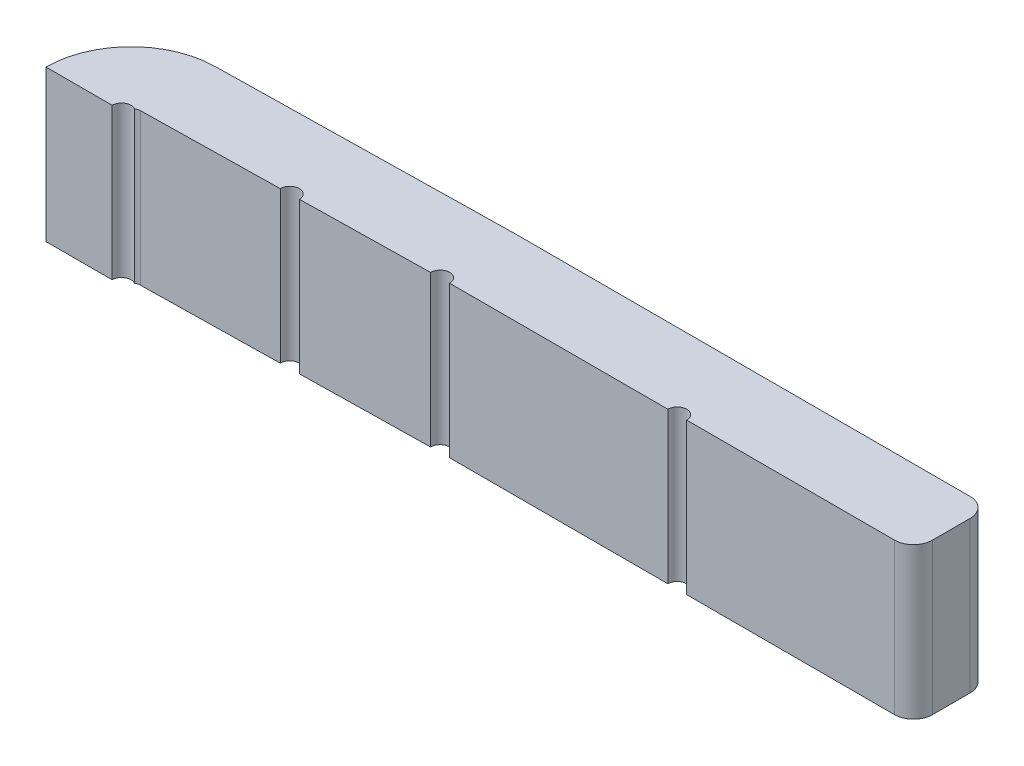
ISO-10303-21;
HEADER;
FILE_DESCRIPTION(('STEP AP214'),'2;1');
FILE_NAME('part.step','',(''),(''),'','','');
FILE_SCHEMA(('AUTOMOTIVE_DESIGN { 1 0 10303 214 1 1 1 1 }'));
ENDSEC;
DATA;
#1=APPLICATION_CONTEXT('core data for automotive mechanical design processes');
#2=APPLICATION_PROTOCOL_DEFINITION('international standard','automotive_design',2000,#1);
#3=PRODUCT_CONTEXT('',#1,'mechanical');
#4=PRODUCT('Part','Part','',(#3));
#5=PRODUCT_RELATED_PRODUCT_CATEGORY('part','',(#4));
#6=PRODUCT_DEFINITION_FORMATION('','',#4);
#7=PRODUCT_DEFINITION_CONTEXT('part definition',#1,'design');
#8=PRODUCT_DEFINITION('design','',#6,#7);
#9=PRODUCT_DEFINITION_SHAPE('','',#8);
#10=(LENGTH_UNIT() NAMED_UNIT(*) SI_UNIT(.MILLI.,.METRE.));
#11=(NAMED_UNIT(*) PLANE_ANGLE_UNIT() SI_UNIT($,.RADIAN.));
#12=(NAMED_UNIT(*) SI_UNIT($,.STERADIAN.) SOLID_ANGLE_UNIT());
#13=UNCERTAINTY_MEASURE_WITH_UNIT(LENGTH_MEASURE(1.E-05),#10,'distance_accuracy_value','');
#14=(GEOMETRIC_REPRESENTATION_CONTEXT(3) GLOBAL_UNCERTAINTY_ASSIGNED_CONTEXT((#13)) GLOBAL_UNIT_ASSIGNED_CONTEXT((#10,
#11,#12)) REPRESENTATION_CONTEXT('',''));
#15=CARTESIAN_POINT('',(0.,0.,0.));
#16=DIRECTION('',(0.,0.,1.));
#17=DIRECTION('',(1.,0.,0.));
#18=AXIS2_PLACEMENT_3D('',#15,#16,#17);
#19=CARTESIAN_POINT('',(0.25,0.8,0.));
#20=DIRECTION('',(0.,-1.,0.));
#21=DIRECTION('',(0.,0.,-1.));
#22=AXIS2_PLACEMENT_3D('',#19,#20,#21);
#23=CYLINDRICAL_SURFACE('',#22,0.45);
#24=DIRECTION('',(0.,-1.,0.));
#25=VECTOR('',#24,1.);
#26=CARTESIAN_POINT('',(-0.2,0.8,0.));
#27=LINE('',#26,#25);
#28=CARTESIAN_POINT('',(-0.2,0.8,0.));
#29=VERTEX_POINT('',#28);
#30=CARTESIAN_POINT('',(-0.2,0.,0.));
#31=VERTEX_POINT('',#30);
#32=EDGE_CURVE('E55',#29,#31,#27,.T.);
#33=ORIENTED_EDGE('',*,*,#32,.F.);
#34=CARTESIAN_POINT('',(0.25,0.8,0.));
#35=DIRECTION('',(0.,1.,0.));
#36=DIRECTION('',(0.,0.,-1.));
#37=AXIS2_PLACEMENT_3D('',#34,#35,#36);
#38=CIRCLE('',#37,0.45);
#39=CARTESIAN_POINT('',(0.242146417103225,0.8,-0.449931462820376));
#40=VERTEX_POINT('',#39);
#41=EDGE_CURVE('E174',#40,#29,#38,.T.);
#42=ORIENTED_EDGE('',*,*,#41,.F.);
#43=DIRECTION('',(0.,-1.,0.));
#44=VECTOR('',#43,1.);
#45=CARTESIAN_POINT('',(0.242146417103225,0.8,-0.449931462820376));
#46=LINE('',#45,#44);
#47=CARTESIAN_POINT('',(0.242146417103225,0.,-0.449931462820376));
#48=VERTEX_POINT('',#47);
#49=EDGE_CURVE('E226',#40,#48,#46,.T.);
#50=ORIENTED_EDGE('',*,*,#49,.T.);
#51=CARTESIAN_POINT('',(0.25,0.,0.));
#52=DIRECTION('',(0.,1.,0.));
#53=DIRECTION('',(0.,0.,-1.));
#54=AXIS2_PLACEMENT_3D('',#51,#52,#53);
#55=CIRCLE('',#54,0.45);
#56=EDGE_CURVE('E208',#48,#31,#55,.T.);
#57=ORIENTED_EDGE('',*,*,#56,.T.);
#58=EDGE_LOOP('',(#33,#42,#50,#57));
#59=FACE_BOUND('',#58,.T.);
#60=ADVANCED_FACE('F40',(#59),#23,.T.);
#61=CARTESIAN_POINT('',(0.25,0.8,0.));
#62=DIRECTION('',(0.,1.,0.));
#63=DIRECTION('',(0.,0.,1.));
#64=AXIS2_PLACEMENT_3D('',#61,#62,#63);
#65=PLANE('',#64);
#66=ORIENTED_EDGE('',*,*,#41,.T.);
#67=DIRECTION('',(1.,0.,0.));
#68=VECTOR('',#67,1.);
#69=CARTESIAN_POINT('',(0.25,0.8,0.));
#70=LINE('',#69,#68);
#71=CARTESIAN_POINT('',(0.150000000000046,0.8,0.));
#72=VERTEX_POINT('',#71);
#73=EDGE_CURVE('E172',#29,#72,#70,.T.);
#74=ORIENTED_EDGE('',*,*,#73,.T.);
#75=CARTESIAN_POINT('',(0.200000000000046,0.8,0.));
#76=DIRECTION('',(0.,1.,0.));
#77=DIRECTION('',(0.,0.,1.));
#78=AXIS2_PLACEMENT_3D('',#75,#76,#77);
#79=CIRCLE('',#78,0.0500000000000001);
#80=CARTESIAN_POINT('',(0.225000000000022,0.8,-0.0433012701892349));
#81=VERTEX_POINT('',#80);
#82=EDGE_CURVE('E161',#81,#72,#79,.T.);
#83=ORIENTED_EDGE('',*,*,#82,.F.);
#84=CARTESIAN_POINT('',(0.25,0.8,0.));
#85=DIRECTION('',(0.,-1.,0.));
#86=DIRECTION('',(0.,0.,1.));
#87=AXIS2_PLACEMENT_3D('',#84,#85,#86);
#88=CIRCLE('',#87,0.0500000000000002);
#89=CARTESIAN_POINT('',(0.249127379678136,0.8,-0.0499923847578196));
#90=VERTEX_POINT('',#89);
#91=EDGE_CURVE('E205',#81,#90,#88,.T.);
#92=ORIENTED_EDGE('',*,*,#91,.T.);
#93=DIRECTION('',(0.999847695156391,0.,-0.0174524064372769));
#94=VECTOR('',#93,1.);
#95=CARTESIAN_POINT('',(1.80452536755562,0.8,-0.0771419576254298));
#96=LINE('',#95,#94);
#97=CARTESIAN_POINT('',(0.97683398885906,0.8,-0.0626945508697608));
#98=VERTEX_POINT('',#97);
#99=EDGE_CURVE('E209',#90,#98,#96,.T.);
#100=ORIENTED_EDGE('',*,*,#99,.T.);
#101=CARTESIAN_POINT('',(1.02682637361688,0.8,-0.0635671711916247));
#102=DIRECTION('',(0.,1.,0.));
#103=DIRECTION('',(0.,0.,1.));
#104=AXIS2_PLACEMENT_3D('',#101,#102,#103);
#105=CIRCLE('',#104,0.0500000000000002);
#106=CARTESIAN_POINT('',(1.0768187583747,0.8,-0.0644397915134885));
#107=VERTEX_POINT('',#106);
#108=EDGE_CURVE('E180',#107,#98,#105,.T.);
#109=ORIENTED_EDGE('',*,*,#108,.F.);
#110=CARTESIAN_POINT('',(1.75889558962426,0.8,-0.0763454868889779));
#111=VERTEX_POINT('',#110);
#112=EDGE_CURVE('E207',#107,#111,#96,.T.);
#113=ORIENTED_EDGE('',*,*,#112,.T.);
#114=CARTESIAN_POINT('',(1.80888830302508,0.8,-0.0771990715793197));
#115=DIRECTION('',(0.,1.,0.));
#116=DIRECTION('',(0.,0.,1.));
#117=AXIS2_PLACEMENT_3D('',#114,#115,#116);
#118=CIRCLE('',#117,0.0499999999999999);
#119=CARTESIAN_POINT('',(1.85888829940044,0.8,-0.0772181100472342));
#120=VERTEX_POINT('',#119);
#121=EDGE_CURVE('E169',#120,#111,#118,.T.);
#122=ORIENTED_EDGE('',*,*,#121,.F.);
#123=DIRECTION('',(1.,0.,0.));
#124=VECTOR('',#123,1.);
#125=CARTESIAN_POINT('',(4.31325157077423,0.8,-0.0772181100472352));
#126=LINE('',#125,#124);
#127=CARTESIAN_POINT('',(3.01325157077425,0.8,-0.0772181100472346));
#128=VERTEX_POINT('',#127);
#129=EDGE_CURVE('E215',#120,#128,#126,.T.);
#130=ORIENTED_EDGE('',*,*,#129,.T.);
#131=CARTESIAN_POINT('',(3.06325157077425,0.8,-0.0772181100472346));
#132=DIRECTION('',(0.,1.,0.));
#133=DIRECTION('',(0.,0.,1.));
#134=AXIS2_PLACEMENT_3D('',#131,#132,#133);
#135=CIRCLE('',#134,0.0500000000000002);
#136=CARTESIAN_POINT('',(3.11325157077425,0.8,-0.0772181100472347));
#137=VERTEX_POINT('',#136);
#138=EDGE_CURVE('E183',#137,#128,#135,.T.);
#139=ORIENTED_EDGE('',*,*,#138,.F.);
#140=CARTESIAN_POINT('',(4.21325157077423,0.8,-0.0772181100472352));
#141=VERTEX_POINT('',#140);
#142=EDGE_CURVE('E212',#137,#141,#126,.T.);
#143=ORIENTED_EDGE('',*,*,#142,.T.);
#144=CARTESIAN_POINT('',(4.21325157077423,0.8,-0.177218110047235));
#145=DIRECTION('',(0.,1.,0.));
#146=DIRECTION('',(0.,0.,1.));
#147=AXIS2_PLACEMENT_3D('',#144,#145,#146);
#148=CIRCLE('',#147,0.1);
#149=CARTESIAN_POINT('',(4.31325157077423,0.8,-0.177218110047235));
#150=VERTEX_POINT('',#149);
#151=EDGE_CURVE('E281',#141,#150,#148,.T.);
#152=ORIENTED_EDGE('',*,*,#151,.T.);
#153=DIRECTION('',(0.,0.,-1.));
#154=VECTOR('',#153,1.);
#155=CARTESIAN_POINT('',(4.31325157077423,0.8,-0.477218110047233));
#156=LINE('',#155,#154);
#157=CARTESIAN_POINT('',(4.31325157077423,0.8,-0.377218110047233));
#158=VERTEX_POINT('',#157);
#159=EDGE_CURVE('E216',#150,#158,#156,.T.);
#160=ORIENTED_EDGE('',*,*,#159,.T.);
#161=CARTESIAN_POINT('',(4.21325157077423,0.8,-0.377218110047233));
#162=DIRECTION('',(0.,1.,0.));
#163=DIRECTION('',(0.,0.,1.));
#164=AXIS2_PLACEMENT_3D('',#161,#162,#163);
#165=CIRCLE('',#164,0.1);
#166=CARTESIAN_POINT('',(4.21325157077423,0.8,-0.477218110047233));
#167=VERTEX_POINT('',#166);
#168=EDGE_CURVE('E279',#158,#167,#165,.T.);
#169=ORIENTED_EDGE('',*,*,#168,.T.);
#170=DIRECTION('',(-1.,0.,0.));
#171=VECTOR('',#170,1.);
#172=CARTESIAN_POINT('',(1.81325157077426,0.8,-0.477218110047232));
#173=LINE('',#172,#171);
#174=CARTESIAN_POINT('',(1.81325157077426,0.8,-0.477218110047232));
#175=VERTEX_POINT('',#174);
#176=EDGE_CURVE('E219',#167,#175,#173,.T.);
#177=ORIENTED_EDGE('',*,*,#176,.T.);
#178=CARTESIAN_POINT('',(1.81325157077426,0.8,0.422781889967624));
#179=DIRECTION('',(0.,1.,0.));
#180=DIRECTION('',(0.,0.,-1.));
#181=AXIS2_PLACEMENT_3D('',#178,#179,#180);
#182=CIRCLE('',#181,0.900000000014855);
#183=CARTESIAN_POINT('',(1.7975444049807,0.8,-0.477081035687986));
#184=VERTEX_POINT('',#183);
#185=EDGE_CURVE('E221',#175,#184,#182,.T.);
#186=ORIENTED_EDGE('',*,*,#185,.T.);
#187=DIRECTION('',(-0.999847695156391,0.,0.017452406437277));
#188=VECTOR('',#187,1.);
#189=CARTESIAN_POINT('',(0.242146417103225,0.8,-0.449931462820376));
#190=LINE('',#189,#188);
#191=EDGE_CURVE('E223',#184,#40,#190,.T.);
#192=ORIENTED_EDGE('',*,*,#191,.T.);
#193=EDGE_LOOP('',(#66,#74,#83,#92,#100,#109,#113,#122,#130,#139,#143,#152,#160,#169,#177,#186,#192));
#194=FACE_BOUND('',#193,.T.);
#195=ADVANCED_FACE('F173',(#194),#65,.T.);
#196=CARTESIAN_POINT('',(0.25,0.,0.));
#197=DIRECTION('',(0.,1.,0.));
#198=DIRECTION('',(0.,0.,1.));
#199=AXIS2_PLACEMENT_3D('',#196,#197,#198);
#200=PLANE('',#199);
#201=DIRECTION('',(1.,0.,0.));
#202=VECTOR('',#201,1.);
#203=CARTESIAN_POINT('',(0.25,0.,0.));
#204=LINE('',#203,#202);
#205=CARTESIAN_POINT('',(0.150000000000046,0.,0.));
#206=VERTEX_POINT('',#205);
#207=EDGE_CURVE('E63',#31,#206,#204,.T.);
#208=ORIENTED_EDGE('',*,*,#207,.F.);
#209=ORIENTED_EDGE('',*,*,#56,.F.);
#210=DIRECTION('',(-0.999847695156391,0.,0.017452406437277));
#211=VECTOR('',#210,1.);
#212=CARTESIAN_POINT('',(0.242146417103225,0.,-0.449931462820376));
#213=LINE('',#212,#211);
#214=CARTESIAN_POINT('',(1.7975444049807,0.,-0.477081035687986));
#215=VERTEX_POINT('',#214);
#216=EDGE_CURVE('E243',#215,#48,#213,.T.);
#217=ORIENTED_EDGE('',*,*,#216,.F.);
#218=CARTESIAN_POINT('',(1.81325157077426,0.,0.422781889967624));
#219=DIRECTION('',(0.,1.,0.));
#220=DIRECTION('',(0.,0.,-1.));
#221=AXIS2_PLACEMENT_3D('',#218,#219,#220);
#222=CIRCLE('',#221,0.900000000014855);
#223=CARTESIAN_POINT('',(1.81325157077426,0.,-0.477218110047232));
#224=VERTEX_POINT('',#223);
#225=EDGE_CURVE('E241',#224,#215,#222,.T.);
#226=ORIENTED_EDGE('',*,*,#225,.F.);
#227=DIRECTION('',(-1.,0.,0.));
#228=VECTOR('',#227,1.);
#229=CARTESIAN_POINT('',(1.81325157077426,0.,-0.477218110047232));
#230=LINE('',#229,#228);
#231=CARTESIAN_POINT('',(4.21325157077423,0.,-0.477218110047233));
#232=VERTEX_POINT('',#231);
#233=EDGE_CURVE('E239',#232,#224,#230,.T.);
#234=ORIENTED_EDGE('',*,*,#233,.F.);
#235=CARTESIAN_POINT('',(4.21325157077423,0.,-0.377218110047233));
#236=DIRECTION('',(0.,1.,0.));
#237=DIRECTION('',(0.,0.,1.));
#238=AXIS2_PLACEMENT_3D('',#235,#236,#237);
#239=CIRCLE('',#238,0.1);
#240=CARTESIAN_POINT('',(4.31325157077423,0.,-0.377218110047233));
#241=VERTEX_POINT('',#240);
#242=EDGE_CURVE('E273',#232,#241,#239,.F.);
#243=ORIENTED_EDGE('',*,*,#242,.T.);
#244=DIRECTION('',(0.,0.,-1.));
#245=VECTOR('',#244,1.);
#246=CARTESIAN_POINT('',(4.31325157077423,0.,-0.477218110047233));
#247=LINE('',#246,#245);
#248=CARTESIAN_POINT('',(4.31325157077423,0.,-0.177218110047235));
#249=VERTEX_POINT('',#248);
#250=EDGE_CURVE('E236',#249,#241,#247,.T.);
#251=ORIENTED_EDGE('',*,*,#250,.F.);
#252=CARTESIAN_POINT('',(4.21325157077423,0.,-0.177218110047235));
#253=DIRECTION('',(0.,1.,0.));
#254=DIRECTION('',(0.,0.,1.));
#255=AXIS2_PLACEMENT_3D('',#252,#253,#254);
#256=CIRCLE('',#255,0.1);
#257=CARTESIAN_POINT('',(4.21325157077423,0.,-0.0772181100472352));
#258=VERTEX_POINT('',#257);
#259=EDGE_CURVE('E275',#249,#258,#256,.F.);
#260=ORIENTED_EDGE('',*,*,#259,.T.);
#261=DIRECTION('',(1.,0.,0.));
#262=VECTOR('',#261,1.);
#263=CARTESIAN_POINT('',(4.31325157077423,0.,-0.0772181100472352));
#264=LINE('',#263,#262);
#265=CARTESIAN_POINT('',(3.11325157077425,0.,-0.0772181100472347));
#266=VERTEX_POINT('',#265);
#267=EDGE_CURVE('E232',#266,#258,#264,.T.);
#268=ORIENTED_EDGE('',*,*,#267,.F.);
#269=CARTESIAN_POINT('',(3.06325157077425,0.,-0.0772181100472346));
#270=DIRECTION('',(0.,1.,0.));
#271=DIRECTION('',(0.,0.,1.));
#272=AXIS2_PLACEMENT_3D('',#269,#270,#271);
#273=CIRCLE('',#272,0.0500000000000002);
#274=CARTESIAN_POINT('',(3.01325157077425,0.,-0.0772181100472346));
#275=VERTEX_POINT('',#274);
#276=EDGE_CURVE('E260',#266,#275,#273,.T.);
#277=ORIENTED_EDGE('',*,*,#276,.T.);
#278=CARTESIAN_POINT('',(1.85888829940044,0.,-0.0772181100472342));
#279=VERTEX_POINT('',#278);
#280=EDGE_CURVE('E235',#279,#275,#264,.T.);
#281=ORIENTED_EDGE('',*,*,#280,.F.);
#282=CARTESIAN_POINT('',(1.80888830302508,0.,-0.0771990715793197));
#283=DIRECTION('',(0.,1.,0.));
#284=DIRECTION('',(0.,0.,1.));
#285=AXIS2_PLACEMENT_3D('',#282,#283,#284);
#286=CIRCLE('',#285,0.0499999999999999);
#287=CARTESIAN_POINT('',(1.75889558962426,0.,-0.0763454868889779));
#288=VERTEX_POINT('',#287);
#289=EDGE_CURVE('E263',#279,#288,#286,.T.);
#290=ORIENTED_EDGE('',*,*,#289,.T.);
#291=DIRECTION('',(0.999847695156391,0.,-0.0174524064372769));
#292=VECTOR('',#291,1.);
#293=CARTESIAN_POINT('',(1.80452536755562,0.,-0.0771419576254298));
#294=LINE('',#293,#292);
#295=CARTESIAN_POINT('',(1.0768187583747,0.,-0.0644397915134885));
#296=VERTEX_POINT('',#295);
#297=EDGE_CURVE('E228',#296,#288,#294,.T.);
#298=ORIENTED_EDGE('',*,*,#297,.F.);
#299=CARTESIAN_POINT('',(1.02682637361688,0.,-0.0635671711916247));
#300=DIRECTION('',(0.,1.,0.));
#301=DIRECTION('',(0.,0.,1.));
#302=AXIS2_PLACEMENT_3D('',#299,#300,#301);
#303=CIRCLE('',#302,0.0500000000000002);
#304=CARTESIAN_POINT('',(0.97683398885906,0.,-0.0626945508697608));
#305=VERTEX_POINT('',#304);
#306=EDGE_CURVE('E257',#296,#305,#303,.T.);
#307=ORIENTED_EDGE('',*,*,#306,.T.);
#308=CARTESIAN_POINT('',(0.249127379678136,0.,-0.0499923847578196));
#309=VERTEX_POINT('',#308);
#310=EDGE_CURVE('E229',#309,#305,#294,.T.);
#311=ORIENTED_EDGE('',*,*,#310,.F.);
#312=CARTESIAN_POINT('',(0.25,0.,0.));
#313=DIRECTION('',(0.,-1.,0.));
#314=DIRECTION('',(0.,0.,1.));
#315=AXIS2_PLACEMENT_3D('',#312,#313,#314);
#316=CIRCLE('',#315,0.0500000000000002);
#317=CARTESIAN_POINT('',(0.225000000000022,0.,-0.0433012701892349));
#318=VERTEX_POINT('',#317);
#319=EDGE_CURVE('E204',#318,#309,#316,.T.);
#320=ORIENTED_EDGE('',*,*,#319,.F.);
#321=CARTESIAN_POINT('',(0.200000000000046,0.,0.));
#322=DIRECTION('',(0.,1.,0.));
#323=DIRECTION('',(0.,0.,1.));
#324=AXIS2_PLACEMENT_3D('',#321,#322,#323);
#325=CIRCLE('',#324,0.0500000000000001);
#326=EDGE_CURVE('E266',#318,#206,#325,.T.);
#327=ORIENTED_EDGE('',*,*,#326,.T.);
#328=EDGE_LOOP('',(#208,#209,#217,#226,#234,#243,#251,#260,#268,#277,#281,#290,#298,#307,#311,
#320,#327));
#329=FACE_BOUND('',#328,.T.);
#330=ADVANCED_FACE('F292',(#329),#200,.F.);
#331=CARTESIAN_POINT('',(0.200000000000046,-9.2,0.));
#332=DIRECTION('',(0.,1.,0.));
#333=DIRECTION('',(0.,0.,1.));
#334=AXIS2_PLACEMENT_3D('',#331,#332,#333);
#335=CYLINDRICAL_SURFACE('',#334,0.0500000000000001);
#336=DIRECTION('',(0.,1.,0.));
#337=VECTOR('',#336,1.);
#338=CARTESIAN_POINT('',(0.150000000000046,-9.2,0.));
#339=LINE('',#338,#337);
#340=EDGE_CURVE('E12',#206,#72,#339,.T.);
#341=ORIENTED_EDGE('',*,*,#340,.F.);
#342=ORIENTED_EDGE('',*,*,#326,.F.);
#343=DIRECTION('',(0.,1.,0.));
#344=VECTOR('',#343,1.);
#345=CARTESIAN_POINT('',(0.225000000000022,-4.2,-0.0433012701892349));
#346=LINE('',#345,#344);
#347=EDGE_CURVE('E165',#81,#318,#346,.F.);
#348=ORIENTED_EDGE('',*,*,#347,.F.);
#349=ORIENTED_EDGE('',*,*,#82,.T.);
#350=EDGE_LOOP('',(#341,#342,#348,#349));
#351=FACE_BOUND('',#350,.T.);
#352=ADVANCED_FACE('F163',(#351),#335,.F.);
#353=CARTESIAN_POINT('',(0.25,0.8,0.));
#354=DIRECTION('',(0.,-1.,0.));
#355=DIRECTION('',(0.,0.,-1.));
#356=AXIS2_PLACEMENT_3D('',#353,#354,#355);
#357=CYLINDRICAL_SURFACE('',#356,0.0500000000000002);
#358=ORIENTED_EDGE('',*,*,#91,.F.);
#359=ORIENTED_EDGE('',*,*,#347,.T.);
#360=ORIENTED_EDGE('',*,*,#319,.T.);
#361=DIRECTION('',(0.,-1.,0.));
#362=VECTOR('',#361,1.);
#363=CARTESIAN_POINT('',(0.249127379678136,0.8,-0.0499923847578196));
#364=LINE('',#363,#362);
#365=EDGE_CURVE('E254',#90,#309,#364,.T.);
#366=ORIENTED_EDGE('',*,*,#365,.F.);
#367=EDGE_LOOP('',(#358,#359,#360,#366));
#368=FACE_BOUND('',#367,.T.);
#369=ADVANCED_FACE('F341',(#368),#357,.F.);
#370=CARTESIAN_POINT('',(1.80452536755562,0.8,-0.0771419576254298));
#371=DIRECTION('',(-0.0174524064372769,0.,-0.999847695156391));
#372=DIRECTION('',(-0.999847695156391,0.,0.0174524064372769));
#373=AXIS2_PLACEMENT_3D('',#370,#371,#372);
#374=PLANE('',#373);
#375=ORIENTED_EDGE('',*,*,#310,.T.);
#376=DIRECTION('',(0.,1.,0.));
#377=VECTOR('',#376,1.);
#378=CARTESIAN_POINT('',(0.97683398885906,-9.2,-0.0626945508697608));
#379=LINE('',#378,#377);
#380=EDGE_CURVE('E188',#305,#98,#379,.T.);
#381=ORIENTED_EDGE('',*,*,#380,.T.);
#382=ORIENTED_EDGE('',*,*,#99,.F.);
#383=ORIENTED_EDGE('',*,*,#365,.T.);
#384=EDGE_LOOP('',(#375,#381,#382,#383));
#385=FACE_BOUND('',#384,.T.);
#386=ADVANCED_FACE('F339',(#385),#374,.F.);
#387=CARTESIAN_POINT('',(4.31325157077423,0.8,-0.0772181100472352));
#388=DIRECTION('',(0.,0.,-1.));
#389=DIRECTION('',(-1.,0.,0.));
#390=AXIS2_PLACEMENT_3D('',#387,#388,#389);
#391=PLANE('',#390);
#392=ORIENTED_EDGE('',*,*,#129,.F.);
#393=DIRECTION('',(0.,1.,0.));
#394=VECTOR('',#393,1.);
#395=CARTESIAN_POINT('',(1.85888829940044,-9.2,-0.0772181100472342));
#396=LINE('',#395,#394);
#397=EDGE_CURVE('E197',#120,#279,#396,.F.);
#398=ORIENTED_EDGE('',*,*,#397,.T.);
#399=ORIENTED_EDGE('',*,*,#280,.T.);
#400=DIRECTION('',(0.,1.,0.));
#401=VECTOR('',#400,1.);
#402=CARTESIAN_POINT('',(3.01325157077425,-9.2,-0.0772181100472346));
#403=LINE('',#402,#401);
#404=EDGE_CURVE('E194',#275,#128,#403,.T.);
#405=ORIENTED_EDGE('',*,*,#404,.T.);
#406=EDGE_LOOP('',(#392,#398,#399,#405));
#407=FACE_BOUND('',#406,.T.);
#408=ADVANCED_FACE('F324',(#407),#391,.F.);
#409=ORIENTED_EDGE('',*,*,#297,.T.);
#410=DIRECTION('',(0.,1.,0.));
#411=VECTOR('',#410,1.);
#412=CARTESIAN_POINT('',(1.75889558962426,-9.2,-0.0763454868889779));
#413=LINE('',#412,#411);
#414=EDGE_CURVE('E200',#288,#111,#413,.T.);
#415=ORIENTED_EDGE('',*,*,#414,.T.);
#416=ORIENTED_EDGE('',*,*,#112,.F.);
#417=DIRECTION('',(0.,1.,0.));
#418=VECTOR('',#417,1.);
#419=CARTESIAN_POINT('',(1.0768187583747,-9.2,-0.0644397915134885));
#420=LINE('',#419,#418);
#421=EDGE_CURVE('E168',#107,#296,#420,.F.);
#422=ORIENTED_EDGE('',*,*,#421,.T.);
#423=EDGE_LOOP('',(#409,#415,#416,#422));
#424=FACE_BOUND('',#423,.T.);
#425=ADVANCED_FACE('F330',(#424),#374,.F.);
#426=ORIENTED_EDGE('',*,*,#267,.T.);
#427=DIRECTION('',(0.,-1.,0.));
#428=VECTOR('',#427,1.);
#429=CARTESIAN_POINT('',(4.21325157077423,0.8,-0.0772181100472352));
#430=LINE('',#429,#428);
#431=EDGE_CURVE('E277',#258,#141,#430,.F.);
#432=ORIENTED_EDGE('',*,*,#431,.T.);
#433=ORIENTED_EDGE('',*,*,#142,.F.);
#434=DIRECTION('',(0.,1.,0.));
#435=VECTOR('',#434,1.);
#436=CARTESIAN_POINT('',(3.11325157077425,-9.2,-0.0772181100472347));
#437=LINE('',#436,#435);
#438=EDGE_CURVE('E191',#137,#266,#437,.F.);
#439=ORIENTED_EDGE('',*,*,#438,.T.);
#440=EDGE_LOOP('',(#426,#432,#433,#439));
#441=FACE_BOUND('',#440,.T.);
#442=ADVANCED_FACE('F312',(#441),#391,.F.);
#443=CARTESIAN_POINT('',(4.31325157077423,0.8,-0.477218110047233));
#444=DIRECTION('',(-1.,0.,0.));
#445=DIRECTION('',(0.,0.,1.));
#446=AXIS2_PLACEMENT_3D('',#443,#444,#445);
#447=PLANE('',#446);
#448=ORIENTED_EDGE('',*,*,#159,.F.);
#449=DIRECTION('',(0.,-1.,0.));
#450=VECTOR('',#449,1.);
#451=CARTESIAN_POINT('',(4.31325157077423,0.8,-0.177218110047235));
#452=LINE('',#451,#450);
#453=EDGE_CURVE('E270',#150,#249,#452,.T.);
#454=ORIENTED_EDGE('',*,*,#453,.T.);
#455=ORIENTED_EDGE('',*,*,#250,.T.);
#456=DIRECTION('',(0.,-1.,0.));
#457=VECTOR('',#456,1.);
#458=CARTESIAN_POINT('',(4.31325157077423,0.8,-0.377218110047233));
#459=LINE('',#458,#457);
#460=EDGE_CURVE('E268',#241,#158,#459,.F.);
#461=ORIENTED_EDGE('',*,*,#460,.T.);
#462=EDGE_LOOP('',(#448,#454,#455,#461));
#463=FACE_BOUND('',#462,.T.);
#464=ADVANCED_FACE('F306',(#463),#447,.F.);
#465=CARTESIAN_POINT('',(1.81325157077426,0.8,-0.477218110047232));
#466=DIRECTION('',(0.,0.,1.));
#467=DIRECTION('',(1.,0.,0.));
#468=AXIS2_PLACEMENT_3D('',#465,#466,#467);
#469=PLANE('',#468);
#470=ORIENTED_EDGE('',*,*,#176,.F.);
#471=DIRECTION('',(0.,-1.,0.));
#472=VECTOR('',#471,1.);
#473=CARTESIAN_POINT('',(4.21325157077423,0.8,-0.477218110047233));
#474=LINE('',#473,#472);
#475=EDGE_CURVE('E48',#167,#232,#474,.T.);
#476=ORIENTED_EDGE('',*,*,#475,.T.);
#477=ORIENTED_EDGE('',*,*,#233,.T.);
#478=DIRECTION('',(0.,-1.,0.));
#479=VECTOR('',#478,1.);
#480=CARTESIAN_POINT('',(1.81325157077426,0.8,-0.477218110047232));
#481=LINE('',#480,#479);
#482=EDGE_CURVE('E251',#175,#224,#481,.T.);
#483=ORIENTED_EDGE('',*,*,#482,.F.);
#484=EDGE_LOOP('',(#470,#476,#477,#483));
#485=FACE_BOUND('',#484,.T.);
#486=ADVANCED_FACE('F287',(#485),#469,.F.);
#487=CARTESIAN_POINT('',(1.81325157077426,0.8,0.422781889967624));
#488=DIRECTION('',(0.,-1.,0.));
#489=DIRECTION('',(0.,0.,-1.));
#490=AXIS2_PLACEMENT_3D('',#487,#488,#489);
#491=CYLINDRICAL_SURFACE('',#490,0.900000000014855);
#492=ORIENTED_EDGE('',*,*,#225,.T.);
#493=DIRECTION('',(0.,-1.,0.));
#494=VECTOR('',#493,1.);
#495=CARTESIAN_POINT('',(1.7975444049807,0.8,-0.477081035687986));
#496=LINE('',#495,#494);
#497=EDGE_CURVE('E248',#184,#215,#496,.T.);
#498=ORIENTED_EDGE('',*,*,#497,.F.);
#499=ORIENTED_EDGE('',*,*,#185,.F.);
#500=ORIENTED_EDGE('',*,*,#482,.T.);
#501=EDGE_LOOP('',(#492,#498,#499,#500));
#502=FACE_BOUND('',#501,.T.);
#503=ADVANCED_FACE('F297',(#502),#491,.T.);
#504=CARTESIAN_POINT('',(0.242146417103225,0.8,-0.449931462820376));
#505=DIRECTION('',(0.017452406437277,0.,0.999847695156391));
#506=DIRECTION('',(0.999847695156391,0.,-0.017452406437277));
#507=AXIS2_PLACEMENT_3D('',#504,#505,#506);
#508=PLANE('',#507);
#509=ORIENTED_EDGE('',*,*,#216,.T.);
#510=ORIENTED_EDGE('',*,*,#49,.F.);
#511=ORIENTED_EDGE('',*,*,#191,.F.);
#512=ORIENTED_EDGE('',*,*,#497,.T.);
#513=EDGE_LOOP('',(#509,#510,#511,#512));
#514=FACE_BOUND('',#513,.T.);
#515=ADVANCED_FACE('F301',(#514),#508,.F.);
#516=CARTESIAN_POINT('',(1.02682637361688,-9.2,-0.0635671711916247));
#517=DIRECTION('',(0.,1.,0.));
#518=DIRECTION('',(0.,0.,1.));
#519=AXIS2_PLACEMENT_3D('',#516,#517,#518);
#520=CYLINDRICAL_SURFACE('',#519,0.0500000000000002);
#521=ORIENTED_EDGE('',*,*,#306,.F.);
#522=ORIENTED_EDGE('',*,*,#421,.F.);
#523=ORIENTED_EDGE('',*,*,#108,.T.);
#524=ORIENTED_EDGE('',*,*,#380,.F.);
#525=EDGE_LOOP('',(#521,#522,#523,#524));
#526=FACE_BOUND('',#525,.T.);
#527=ADVANCED_FACE('F335',(#526),#520,.F.);
#528=CARTESIAN_POINT('',(3.06325157077425,-9.2,-0.0772181100472346));
#529=DIRECTION('',(0.,1.,0.));
#530=DIRECTION('',(0.,0.,1.));
#531=AXIS2_PLACEMENT_3D('',#528,#529,#530);
#532=CYLINDRICAL_SURFACE('',#531,0.0500000000000002);
#533=ORIENTED_EDGE('',*,*,#276,.F.);
#534=ORIENTED_EDGE('',*,*,#438,.F.);
#535=ORIENTED_EDGE('',*,*,#138,.T.);
#536=ORIENTED_EDGE('',*,*,#404,.F.);
#537=EDGE_LOOP('',(#533,#534,#535,#536));
#538=FACE_BOUND('',#537,.T.);
#539=ADVANCED_FACE('F321',(#538),#532,.F.);
#540=CARTESIAN_POINT('',(1.80888830302508,-9.2,-0.0771990715793197));
#541=DIRECTION('',(0.,1.,0.));
#542=DIRECTION('',(0.,0.,1.));
#543=AXIS2_PLACEMENT_3D('',#540,#541,#542);
#544=CYLINDRICAL_SURFACE('',#543,0.0499999999999999);
#545=ORIENTED_EDGE('',*,*,#289,.F.);
#546=ORIENTED_EDGE('',*,*,#397,.F.);
#547=ORIENTED_EDGE('',*,*,#121,.T.);
#548=ORIENTED_EDGE('',*,*,#414,.F.);
#549=EDGE_LOOP('',(#545,#546,#547,#548));
#550=FACE_BOUND('',#549,.T.);
#551=ADVANCED_FACE('F419',(#550),#544,.F.);
#552=CARTESIAN_POINT('',(4.21325157077423,0.8,-0.177218110047235));
#553=DIRECTION('',(0.,-1.,0.));
#554=DIRECTION('',(0.,0.,-1.));
#555=AXIS2_PLACEMENT_3D('',#552,#553,#554);
#556=CYLINDRICAL_SURFACE('',#555,0.1);
#557=ORIENTED_EDGE('',*,*,#151,.F.);
#558=ORIENTED_EDGE('',*,*,#431,.F.);
#559=ORIENTED_EDGE('',*,*,#259,.F.);
#560=ORIENTED_EDGE('',*,*,#453,.F.);
#561=EDGE_LOOP('',(#557,#558,#559,#560));
#562=FACE_BOUND('',#561,.T.);
#563=ADVANCED_FACE('F315',(#562),#556,.T.);
#564=CARTESIAN_POINT('',(4.21325157077423,0.8,-0.377218110047233));
#565=DIRECTION('',(0.,-1.,0.));
#566=DIRECTION('',(0.,0.,-1.));
#567=AXIS2_PLACEMENT_3D('',#564,#565,#566);
#568=CYLINDRICAL_SURFACE('',#567,0.1);
#569=ORIENTED_EDGE('',*,*,#168,.F.);
#570=ORIENTED_EDGE('',*,*,#460,.F.);
#571=ORIENTED_EDGE('',*,*,#242,.F.);
#572=ORIENTED_EDGE('',*,*,#475,.F.);
#573=EDGE_LOOP('',(#569,#570,#571,#572));
#574=FACE_BOUND('',#573,.T.);
#575=ADVANCED_FACE('F42',(#574),#568,.T.);
#576=CARTESIAN_POINT('',(0.,0.,0.));
#577=DIRECTION('',(0.,0.,1.));
#578=DIRECTION('',(1.,0.,0.));
#579=AXIS2_PLACEMENT_3D('',#576,#577,#578);
#580=PLANE('',#579);
#581=ORIENTED_EDGE('',*,*,#73,.F.);
#582=ORIENTED_EDGE('',*,*,#32,.T.);
#583=ORIENTED_EDGE('',*,*,#207,.T.);
#584=ORIENTED_EDGE('',*,*,#340,.T.);
#585=EDGE_LOOP('',(#581,#582,#583,#584));
#586=FACE_BOUND('',#585,.T.);
#587=ADVANCED_FACE('F177',(#586),#580,.T.);
#588=CLOSED_SHELL('',(#60,#195,#330,#352,#369,#386,#408,#425,#442,#464,#486,#503,#515,#527,#539,
#551,#563,#575,#587));
#589=MANIFOLD_SOLID_BREP('B2',#588);
#590=ADVANCED_BREP_SHAPE_REPRESENTATION('',(#18,#589),#14);
#591=SHAPE_DEFINITION_REPRESENTATION(#9,#590);
ENDSEC;
END-ISO-10303-21;
